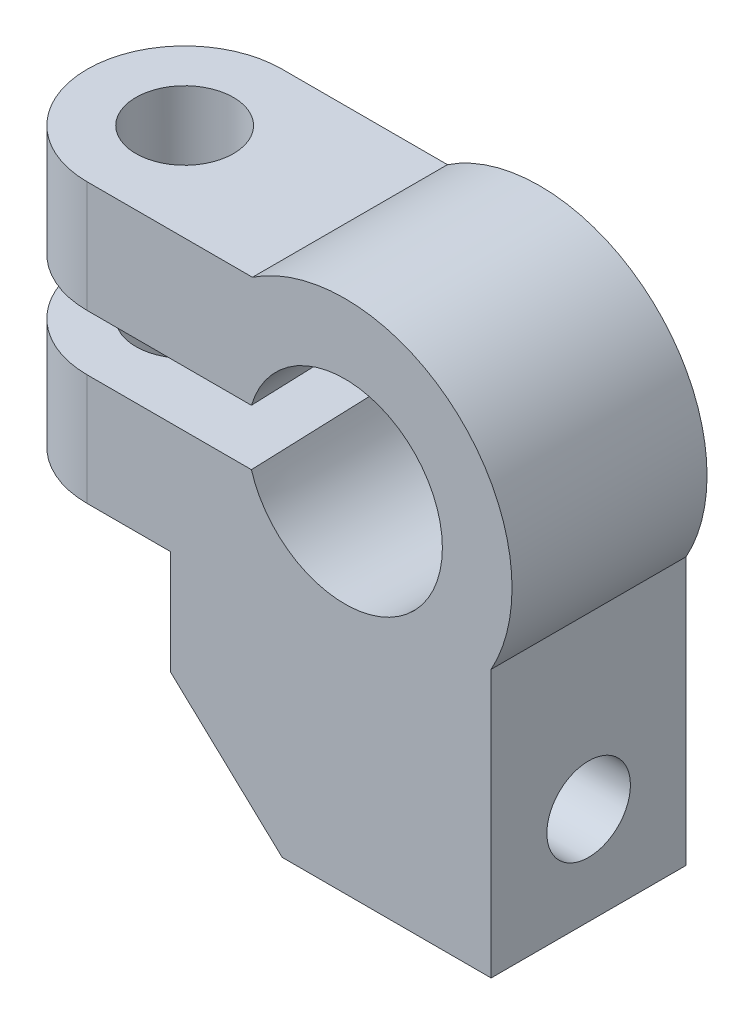
ISO-10303-21;
HEADER;
FILE_DESCRIPTION(('STEP AP214'),'2;1');
FILE_NAME('part.step','',(''),(''),'','','');
FILE_SCHEMA(('AUTOMOTIVE_DESIGN { 1 0 10303 214 1 1 1 1 }'));
ENDSEC;
DATA;
#1=APPLICATION_CONTEXT('core data for automotive mechanical design processes');
#2=APPLICATION_PROTOCOL_DEFINITION('international standard','automotive_design',2000,#1);
#3=PRODUCT_CONTEXT('',#1,'mechanical');
#4=PRODUCT('Part','Part','',(#3));
#5=PRODUCT_RELATED_PRODUCT_CATEGORY('part','',(#4));
#6=PRODUCT_DEFINITION_FORMATION('','',#4);
#7=PRODUCT_DEFINITION_CONTEXT('part definition',#1,'design');
#8=PRODUCT_DEFINITION('design','',#6,#7);
#9=PRODUCT_DEFINITION_SHAPE('','',#8);
#10=(LENGTH_UNIT() NAMED_UNIT(*) SI_UNIT(.MILLI.,.METRE.));
#11=(NAMED_UNIT(*) PLANE_ANGLE_UNIT() SI_UNIT($,.RADIAN.));
#12=(NAMED_UNIT(*) SI_UNIT($,.STERADIAN.) SOLID_ANGLE_UNIT());
#13=UNCERTAINTY_MEASURE_WITH_UNIT(LENGTH_MEASURE(1.E-05),#10,'distance_accuracy_value','');
#14=(GEOMETRIC_REPRESENTATION_CONTEXT(3) GLOBAL_UNCERTAINTY_ASSIGNED_CONTEXT((#13)) GLOBAL_UNIT_ASSIGNED_CONTEXT((#10,
#11,#12)) REPRESENTATION_CONTEXT('',''));
#15=CARTESIAN_POINT('',(0.,0.,0.));
#16=DIRECTION('',(0.,0.,1.));
#17=DIRECTION('',(1.,0.,0.));
#18=AXIS2_PLACEMENT_3D('',#15,#16,#17);
#19=CARTESIAN_POINT('',(0.,0.,28.));
#20=DIRECTION('',(0.,0.,1.));
#21=DIRECTION('',(1.,0.,0.));
#22=AXIS2_PLACEMENT_3D('',#19,#20,#21);
#23=PLANE('',#22);
#24=DIRECTION('',(0.,-1.,0.));
#25=VECTOR('',#24,1.);
#26=CARTESIAN_POINT('',(-37.,-20.,28.));
#27=LINE('',#26,#25);
#28=CARTESIAN_POINT('',(-37.,20.,28.));
#29=VERTEX_POINT('',#28);
#30=CARTESIAN_POINT('',(-37.,4.,28.));
#31=VERTEX_POINT('',#30);
#32=EDGE_CURVE('E608',#29,#31,#27,.T.);
#33=ORIENTED_EDGE('',*,*,#32,.T.);
#34=DIRECTION('',(1.,0.,0.));
#35=VECTOR('',#34,1.);
#36=CARTESIAN_POINT('',(0.,4.,28.));
#37=LINE('',#36,#35);
#38=CARTESIAN_POINT('',(-13.4164078649987,4.,28.));
#39=VERTEX_POINT('',#38);
#40=EDGE_CURVE('E363',#31,#39,#37,.T.);
#41=ORIENTED_EDGE('',*,*,#40,.T.);
#42=CARTESIAN_POINT('',(0.,0.,28.));
#43=DIRECTION('',(0.,0.,1.));
#44=DIRECTION('',(1.,0.,0.));
#45=AXIS2_PLACEMENT_3D('',#42,#43,#44);
#46=CIRCLE('',#45,14.);
#47=CARTESIAN_POINT('',(-13.4164078649987,-4.,28.));
#48=VERTEX_POINT('',#47);
#49=EDGE_CURVE('E635',#48,#39,#46,.T.);
#50=ORIENTED_EDGE('',*,*,#49,.F.);
#51=DIRECTION('',(-1.,0.,0.));
#52=VECTOR('',#51,1.);
#53=CARTESIAN_POINT('',(0.,-4.,28.));
#54=LINE('',#53,#52);
#55=CARTESIAN_POINT('',(-37.,-4.,28.));
#56=VERTEX_POINT('',#55);
#57=EDGE_CURVE('E469',#48,#56,#54,.T.);
#58=ORIENTED_EDGE('',*,*,#57,.T.);
#59=CARTESIAN_POINT('',(-37.,-20.,28.));
#60=VERTEX_POINT('',#59);
#61=EDGE_CURVE('E607',#56,#60,#27,.T.);
#62=ORIENTED_EDGE('',*,*,#61,.T.);
#63=DIRECTION('',(1.,0.,0.));
#64=VECTOR('',#63,1.);
#65=CARTESIAN_POINT('',(-51.,-20.,28.));
#66=LINE('',#65,#64);
#67=CARTESIAN_POINT('',(-25.,-20.,28.));
#68=VERTEX_POINT('',#67);
#69=EDGE_CURVE('E567',#60,#68,#66,.T.);
#70=ORIENTED_EDGE('',*,*,#69,.T.);
#71=DIRECTION('',(0.,-1.,0.));
#72=VECTOR('',#71,1.);
#73=CARTESIAN_POINT('',(-25.,-20.,28.));
#74=LINE('',#73,#72);
#75=CARTESIAN_POINT('',(-25.,-35.,28.));
#76=VERTEX_POINT('',#75);
#77=EDGE_CURVE('E574',#68,#76,#74,.T.);
#78=ORIENTED_EDGE('',*,*,#77,.T.);
#79=DIRECTION('',(0.729537204140085,-0.68394112888133,0.));
#80=VECTOR('',#79,1.);
#81=CARTESIAN_POINT('',(-25.,-35.,28.));
#82=LINE('',#81,#80);
#83=CARTESIAN_POINT('',(-9.,-50.,28.));
#84=VERTEX_POINT('',#83);
#85=EDGE_CURVE('E577',#76,#84,#82,.T.);
#86=ORIENTED_EDGE('',*,*,#85,.T.);
#87=DIRECTION('',(1.,0.,0.));
#88=VECTOR('',#87,1.);
#89=CARTESIAN_POINT('',(-9.,-50.,28.));
#90=LINE('',#89,#88);
#91=CARTESIAN_POINT('',(21.,-50.,28.));
#92=VERTEX_POINT('',#91);
#93=EDGE_CURVE('E585',#84,#92,#90,.T.);
#94=ORIENTED_EDGE('',*,*,#93,.T.);
#95=DIRECTION('',(0.,1.,0.));
#96=VECTOR('',#95,1.);
#97=CARTESIAN_POINT('',(21.,-50.,28.));
#98=LINE('',#97,#96);
#99=CARTESIAN_POINT('',(21.,-11.6189500386222,28.));
#100=VERTEX_POINT('',#99);
#101=EDGE_CURVE('E587',#92,#100,#98,.T.);
#102=ORIENTED_EDGE('',*,*,#101,.T.);
#103=CARTESIAN_POINT('',(0.,0.,28.));
#104=DIRECTION('',(0.,0.,1.));
#105=DIRECTION('',(1.,0.,0.));
#106=AXIS2_PLACEMENT_3D('',#103,#104,#105);
#107=CIRCLE('',#106,24.);
#108=CARTESIAN_POINT('',(-13.2664991614216,20.,28.));
#109=VERTEX_POINT('',#108);
#110=EDGE_CURVE('E589',#100,#109,#107,.T.);
#111=ORIENTED_EDGE('',*,*,#110,.T.);
#112=DIRECTION('',(-1.,0.,0.));
#113=VECTOR('',#112,1.);
#114=CARTESIAN_POINT('',(-51.,20.,28.));
#115=LINE('',#114,#113);
#116=EDGE_CURVE('E575',#109,#29,#115,.T.);
#117=ORIENTED_EDGE('',*,*,#116,.T.);
#118=EDGE_LOOP('',(#33,#41,#50,#58,#62,#70,#78,#86,#94,#102,#111,#117));
#119=FACE_BOUND('',#118,.T.);
#120=ADVANCED_FACE('F348',(#119),#23,.T.);
#121=CARTESIAN_POINT('',(0.,0.,0.));
#122=DIRECTION('',(0.,0.,1.));
#123=DIRECTION('',(1.,0.,0.));
#124=AXIS2_PLACEMENT_3D('',#121,#122,#123);
#125=PLANE('',#124);
#126=DIRECTION('',(1.,0.,0.));
#127=VECTOR('',#126,1.);
#128=CARTESIAN_POINT('',(0.,4.,0.));
#129=LINE('',#128,#127);
#130=CARTESIAN_POINT('',(-37.,4.,0.));
#131=VERTEX_POINT('',#130);
#132=CARTESIAN_POINT('',(-14.4337777464106,4.,0.));
#133=VERTEX_POINT('',#132);
#134=EDGE_CURVE('E664',#131,#133,#129,.T.);
#135=ORIENTED_EDGE('',*,*,#134,.F.);
#136=DIRECTION('',(0.,-1.,0.));
#137=VECTOR('',#136,1.);
#138=CARTESIAN_POINT('',(-37.,0.,0.));
#139=LINE('',#138,#137);
#140=CARTESIAN_POINT('',(-37.,20.,0.));
#141=VERTEX_POINT('',#140);
#142=EDGE_CURVE('E617',#131,#141,#139,.F.);
#143=ORIENTED_EDGE('',*,*,#142,.T.);
#144=DIRECTION('',(-1.,0.,0.));
#145=VECTOR('',#144,1.);
#146=CARTESIAN_POINT('',(-51.,20.,0.));
#147=LINE('',#146,#145);
#148=CARTESIAN_POINT('',(-13.2664991614216,20.,0.));
#149=VERTEX_POINT('',#148);
#150=EDGE_CURVE('E641',#149,#141,#147,.T.);
#151=ORIENTED_EDGE('',*,*,#150,.F.);
#152=CARTESIAN_POINT('',(0.,0.,0.));
#153=DIRECTION('',(0.,0.,1.));
#154=DIRECTION('',(1.,0.,0.));
#155=AXIS2_PLACEMENT_3D('',#152,#153,#154);
#156=CIRCLE('',#155,24.);
#157=CARTESIAN_POINT('',(21.,-11.6189500386222,0.));
#158=VERTEX_POINT('',#157);
#159=EDGE_CURVE('E580',#158,#149,#156,.T.);
#160=ORIENTED_EDGE('',*,*,#159,.F.);
#161=DIRECTION('',(0.,1.,0.));
#162=VECTOR('',#161,1.);
#163=CARTESIAN_POINT('',(21.,-50.,0.));
#164=LINE('',#163,#162);
#165=CARTESIAN_POINT('',(21.,-50.,0.));
#166=VERTEX_POINT('',#165);
#167=EDGE_CURVE('E652',#166,#158,#164,.T.);
#168=ORIENTED_EDGE('',*,*,#167,.F.);
#169=DIRECTION('',(1.,0.,0.));
#170=VECTOR('',#169,1.);
#171=CARTESIAN_POINT('',(-9.,-50.,0.));
#172=LINE('',#171,#170);
#173=CARTESIAN_POINT('',(-9.,-50.,0.));
#174=VERTEX_POINT('',#173);
#175=EDGE_CURVE('E650',#174,#166,#172,.T.);
#176=ORIENTED_EDGE('',*,*,#175,.F.);
#177=DIRECTION('',(0.729537204140085,-0.68394112888133,0.));
#178=VECTOR('',#177,1.);
#179=CARTESIAN_POINT('',(-25.,-35.,0.));
#180=LINE('',#179,#178);
#181=CARTESIAN_POINT('',(-25.,-35.,0.));
#182=VERTEX_POINT('',#181);
#183=EDGE_CURVE('E648',#182,#174,#180,.T.);
#184=ORIENTED_EDGE('',*,*,#183,.F.);
#185=DIRECTION('',(0.,-1.,0.));
#186=VECTOR('',#185,1.);
#187=CARTESIAN_POINT('',(-25.,-20.,0.));
#188=LINE('',#187,#186);
#189=CARTESIAN_POINT('',(-25.,-20.,0.));
#190=VERTEX_POINT('',#189);
#191=EDGE_CURVE('E646',#190,#182,#188,.T.);
#192=ORIENTED_EDGE('',*,*,#191,.F.);
#193=DIRECTION('',(1.,0.,0.));
#194=VECTOR('',#193,1.);
#195=CARTESIAN_POINT('',(-51.,-20.,0.));
#196=LINE('',#195,#194);
#197=CARTESIAN_POINT('',(-37.,-20.,0.));
#198=VERTEX_POINT('',#197);
#199=EDGE_CURVE('E644',#198,#190,#196,.T.);
#200=ORIENTED_EDGE('',*,*,#199,.F.);
#201=CARTESIAN_POINT('',(-37.,-4.,0.));
#202=VERTEX_POINT('',#201);
#203=EDGE_CURVE('E618',#198,#202,#139,.F.);
#204=ORIENTED_EDGE('',*,*,#203,.T.);
#205=DIRECTION('',(-1.,0.,0.));
#206=VECTOR('',#205,1.);
#207=CARTESIAN_POINT('',(0.,-4.,0.));
#208=LINE('',#207,#206);
#209=CARTESIAN_POINT('',(-14.4337777464106,-4.,0.));
#210=VERTEX_POINT('',#209);
#211=EDGE_CURVE('E467',#210,#202,#208,.T.);
#212=ORIENTED_EDGE('',*,*,#211,.F.);
#213=CARTESIAN_POINT('',(0.,0.,0.));
#214=DIRECTION('',(0.,0.,1.));
#215=DIRECTION('',(1.,0.,0.));
#216=AXIS2_PLACEMENT_3D('',#213,#214,#215);
#217=CIRCLE('',#216,14.9777815457689);
#218=EDGE_CURVE('E638',#210,#133,#217,.T.);
#219=ORIENTED_EDGE('',*,*,#218,.T.);
#220=EDGE_LOOP('',(#135,#143,#151,#160,#168,#176,#184,#192,#200,#204,#212,#219));
#221=FACE_BOUND('',#220,.T.);
#222=ADVANCED_FACE('F491',(#221),#125,.F.);
#223=CARTESIAN_POINT('',(0.,0.,28.));
#224=DIRECTION('',(0.,0.,-1.));
#225=DIRECTION('',(1.,0.,0.));
#226=AXIS2_PLACEMENT_3D('',#223,#224,#225);
#227=CONICAL_SURFACE('',#226,14.,0.0349065850398867);
#228=CARTESIAN_POINT('',(-15.3380679210751,4.,-25.0076257256379));
#229=CARTESIAN_POINT('',(-15.165569298085,4.,-20.2277998296334));
#230=CARTESIAN_POINT('',(-14.9928872180665,4.,-15.4479805537252));
#231=CARTESIAN_POINT('',(-14.6471122295986,4.,-5.88835682991105));
#232=CARTESIAN_POINT('',(-14.4740193211466,4.,-1.10855238200515));
#233=CARTESIAN_POINT('',(-13.9540584861186,4.,13.2308362124138));
#234=CARTESIAN_POINT('',(-13.6065084488468,4.,22.7903956380216));
#235=CARTESIAN_POINT('',(-12.8972037729529,4.,42.2364769625243));
#236=CARTESIAN_POINT('',(-12.5353699554243,4.,52.1229959756068));
#237=CARTESIAN_POINT('',(-11.9902581245743,4.,66.9526878728642));
#238=CARTESIAN_POINT('',(-11.808160660422,4.,71.8959041520865));
#239=CARTESIAN_POINT('',(-11.4430546087097,4.,81.7823031030507));
#240=CARTESIAN_POINT('',(-11.2600460211416,4.,86.7254857747924));
#241=CARTESIAN_POINT('',(-11.0765198282129,4.,91.6686492598829));
#242=B_SPLINE_CURVE_WITH_KNOTS('',3,(#228,#229,#230,#231,#232,#233,#234,#235,#236,#237,#238,
#239,#240,#241),.UNSPECIFIED.,.F.,.F.,(4,2,2,2,2,2,4),(0.,14.3488125716595,28.6976252405696,
57.3952504931537,87.0746644263557,101.914371896488,116.754079499273),.UNSPECIFIED.);
#243=EDGE_CURVE('E497',#133,#39,#242,.T.);
#244=ORIENTED_EDGE('',*,*,#243,.F.);
#245=ORIENTED_EDGE('',*,*,#218,.F.);
#246=CARTESIAN_POINT('',(-15.3380679210745,-4.,-25.0076257256217));
#247=CARTESIAN_POINT('',(-15.1655692980845,-4.,-20.2277998296198));
#248=CARTESIAN_POINT('',(-14.9928872180661,-4.,-15.4479805537141));
#249=CARTESIAN_POINT('',(-14.6471122295984,-4.,-5.88835682990489));
#250=CARTESIAN_POINT('',(-14.4740193211464,-4.,-1.1085523820015));
#251=CARTESIAN_POINT('',(-13.9540584861187,-4.,13.2308362124091));
#252=CARTESIAN_POINT('',(-13.6065084488471,-4.,22.7903956380112));
#253=CARTESIAN_POINT('',(-12.8972037729535,-4.,42.2364769625081));
#254=CARTESIAN_POINT('',(-12.5353699554249,-4.,52.1229959755906));
#255=CARTESIAN_POINT('',(-11.9902581245749,-4.,66.9526878728481));
#256=CARTESIAN_POINT('',(-11.8081606604226,-4.,71.8959041520704));
#257=CARTESIAN_POINT('',(-11.4430546087103,-4.,81.7823031030346));
#258=CARTESIAN_POINT('',(-11.2600460211422,-4.,86.7254857747762));
#259=CARTESIAN_POINT('',(-11.0765198282135,-4.,91.6686492598668));
#260=B_SPLINE_CURVE_WITH_KNOTS('',3,(#246,#247,#248,#249,#250,#251,#252,#253,#254,#255,#256,
#257,#258,#259),.UNSPECIFIED.,.F.,.F.,(4,2,2,2,2,2,4),(0.,14.3488125716519,28.6976252405545,
57.3952504931212,87.0746644263234,101.914371896455,116.75407949924),.UNSPECIFIED.);
#261=EDGE_CURVE('E472',#48,#210,#260,.F.);
#262=ORIENTED_EDGE('',*,*,#261,.F.);
#263=ORIENTED_EDGE('',*,*,#49,.T.);
#264=EDGE_LOOP('',(#244,#245,#262,#263));
#265=FACE_BOUND('',#264,.T.);
#266=ADVANCED_FACE('F485',(#265),#227,.F.);
#267=CARTESIAN_POINT('',(-37.,20.,14.));
#268=DIRECTION('',(0.,-1.,0.));
#269=DIRECTION('',(1.,0.,0.));
#270=AXIS2_PLACEMENT_3D('',#267,#268,#269);
#271=CYLINDRICAL_SURFACE('',#270,14.);
#272=ORIENTED_EDGE('',*,*,#142,.F.);
#273=CARTESIAN_POINT('',(-37.,4.,14.));
#274=DIRECTION('',(0.,-1.,0.));
#275=DIRECTION('',(1.,0.,0.));
#276=AXIS2_PLACEMENT_3D('',#273,#274,#275);
#277=CIRCLE('',#276,14.);
#278=CARTESIAN_POINT('',(-51.,4.,14.));
#279=VERTEX_POINT('',#278);
#280=EDGE_CURVE('E668',#131,#279,#277,.F.);
#281=ORIENTED_EDGE('',*,*,#280,.T.);
#282=DIRECTION('',(0.,-1.,0.));
#283=VECTOR('',#282,1.);
#284=CARTESIAN_POINT('',(-51.,20.,14.));
#285=LINE('',#284,#283);
#286=CARTESIAN_POINT('',(-51.,20.,14.));
#287=VERTEX_POINT('',#286);
#288=EDGE_CURVE('E632',#287,#279,#285,.T.);
#289=ORIENTED_EDGE('',*,*,#288,.F.);
#290=CARTESIAN_POINT('',(-37.,20.,14.));
#291=DIRECTION('',(0.,-1.,0.));
#292=DIRECTION('',(0.,0.,-1.));
#293=AXIS2_PLACEMENT_3D('',#290,#291,#292);
#294=CIRCLE('',#293,14.);
#295=EDGE_CURVE('E613',#141,#287,#294,.F.);
#296=ORIENTED_EDGE('',*,*,#295,.F.);
#297=EDGE_LOOP('',(#272,#281,#289,#296));
#298=FACE_BOUND('',#297,.T.);
#299=ADVANCED_FACE('F490',(#298),#271,.T.);
#300=CARTESIAN_POINT('',(-51.,-4.,14.));
#301=VERTEX_POINT('',#300);
#302=CARTESIAN_POINT('',(-51.,-20.,14.));
#303=VERTEX_POINT('',#302);
#304=EDGE_CURVE('E630',#301,#303,#285,.T.);
#305=ORIENTED_EDGE('',*,*,#304,.F.);
#306=CARTESIAN_POINT('',(-37.,-4.,14.));
#307=DIRECTION('',(0.,1.,0.));
#308=DIRECTION('',(0.,0.,1.));
#309=AXIS2_PLACEMENT_3D('',#306,#307,#308);
#310=CIRCLE('',#309,14.);
#311=EDGE_CURVE('E371',#301,#202,#310,.F.);
#312=ORIENTED_EDGE('',*,*,#311,.T.);
#313=ORIENTED_EDGE('',*,*,#203,.F.);
#314=CARTESIAN_POINT('',(-37.,-20.,14.));
#315=DIRECTION('',(0.,1.,0.));
#316=DIRECTION('',(-1.,0.,0.));
#317=AXIS2_PLACEMENT_3D('',#314,#315,#316);
#318=CIRCLE('',#317,14.);
#319=EDGE_CURVE('E610',#303,#198,#318,.F.);
#320=ORIENTED_EDGE('',*,*,#319,.F.);
#321=EDGE_LOOP('',(#305,#312,#313,#320));
#322=FACE_BOUND('',#321,.T.);
#323=ADVANCED_FACE('F518',(#322),#271,.T.);
#324=CARTESIAN_POINT('',(-37.,0.,14.));
#325=DIRECTION('',(0.,1.,0.));
#326=DIRECTION('',(-1.,0.,0.));
#327=AXIS2_PLACEMENT_3D('',#324,#325,#326);
#328=CYLINDRICAL_SURFACE('',#327,14.);
#329=ORIENTED_EDGE('',*,*,#288,.T.);
#330=CARTESIAN_POINT('',(-37.,4.,14.));
#331=DIRECTION('',(0.,-1.,0.));
#332=DIRECTION('',(1.,0.,0.));
#333=AXIS2_PLACEMENT_3D('',#330,#331,#332);
#334=CIRCLE('',#333,14.);
#335=EDGE_CURVE('E479',#279,#31,#334,.F.);
#336=ORIENTED_EDGE('',*,*,#335,.T.);
#337=ORIENTED_EDGE('',*,*,#32,.F.);
#338=CARTESIAN_POINT('',(-37.,20.,14.));
#339=DIRECTION('',(0.,-1.,0.));
#340=DIRECTION('',(0.,0.,-1.));
#341=AXIS2_PLACEMENT_3D('',#338,#339,#340);
#342=CIRCLE('',#341,14.);
#343=EDGE_CURVE('E615',#287,#29,#342,.F.);
#344=ORIENTED_EDGE('',*,*,#343,.F.);
#345=EDGE_LOOP('',(#329,#336,#337,#344));
#346=FACE_BOUND('',#345,.T.);
#347=ADVANCED_FACE('F516',(#346),#328,.T.);
#348=ORIENTED_EDGE('',*,*,#61,.F.);
#349=CARTESIAN_POINT('',(-37.,-4.,14.));
#350=DIRECTION('',(0.,1.,0.));
#351=DIRECTION('',(0.,0.,1.));
#352=AXIS2_PLACEMENT_3D('',#349,#350,#351);
#353=CIRCLE('',#352,14.);
#354=EDGE_CURVE('E462',#56,#301,#353,.F.);
#355=ORIENTED_EDGE('',*,*,#354,.T.);
#356=ORIENTED_EDGE('',*,*,#304,.T.);
#357=CARTESIAN_POINT('',(-37.,-20.,14.));
#358=DIRECTION('',(0.,1.,0.));
#359=DIRECTION('',(-1.,0.,0.));
#360=AXIS2_PLACEMENT_3D('',#357,#358,#359);
#361=CIRCLE('',#360,14.);
#362=EDGE_CURVE('E569',#60,#303,#361,.F.);
#363=ORIENTED_EDGE('',*,*,#362,.F.);
#364=EDGE_LOOP('',(#348,#355,#356,#363));
#365=FACE_BOUND('',#364,.T.);
#366=ADVANCED_FACE('F514',(#365),#328,.T.);
#367=CARTESIAN_POINT('',(-37.,24.,14.));
#368=DIRECTION('',(0.,-1.,0.));
#369=DIRECTION('',(1.,0.,0.));
#370=AXIS2_PLACEMENT_3D('',#367,#368,#369);
#371=CYLINDRICAL_SURFACE('',#370,7.);
#372=CARTESIAN_POINT('',(-37.,20.,14.));
#373=DIRECTION('',(0.,-1.,0.));
#374=DIRECTION('',(0.,0.,-1.));
#375=AXIS2_PLACEMENT_3D('',#372,#373,#374);
#376=CIRCLE('',#375,7.);
#377=CARTESIAN_POINT('',(-37.,20.,7.));
#378=VERTEX_POINT('',#377);
#379=EDGE_CURVE('E628',#378,#378,#376,.T.);
#380=ORIENTED_EDGE('',*,*,#379,.F.);
#381=EDGE_LOOP('',(#380));
#382=FACE_BOUND('',#381,.T.);
#383=CARTESIAN_POINT('',(-37.,4.,14.));
#384=DIRECTION('',(0.,-1.,0.));
#385=DIRECTION('',(1.,0.,0.));
#386=AXIS2_PLACEMENT_3D('',#383,#384,#385);
#387=CIRCLE('',#386,7.);
#388=CARTESIAN_POINT('',(-30.,4.,14.));
#389=VERTEX_POINT('',#388);
#390=EDGE_CURVE('E11',#389,#389,#387,.F.);
#391=ORIENTED_EDGE('',*,*,#390,.F.);
#392=EDGE_LOOP('',(#391));
#393=FACE_BOUND('',#392,.T.);
#394=ADVANCED_FACE('F511',(#382,#393),#371,.F.);
#395=CARTESIAN_POINT('',(-37.,-20.,14.));
#396=DIRECTION('',(0.,-1.,0.));
#397=DIRECTION('',(1.,0.,0.));
#398=AXIS2_PLACEMENT_3D('',#395,#396,#397);
#399=CIRCLE('',#398,7.);
#400=CARTESIAN_POINT('',(-30.,-20.,14.));
#401=VERTEX_POINT('',#400);
#402=EDGE_CURVE('E503',#401,#401,#399,.T.);
#403=ORIENTED_EDGE('',*,*,#402,.T.);
#404=EDGE_LOOP('',(#403));
#405=FACE_BOUND('',#404,.T.);
#406=CARTESIAN_POINT('',(-37.,-4.,14.));
#407=DIRECTION('',(0.,1.,0.));
#408=DIRECTION('',(0.,0.,1.));
#409=AXIS2_PLACEMENT_3D('',#406,#407,#408);
#410=CIRCLE('',#409,7.);
#411=CARTESIAN_POINT('',(-37.,-4.,21.));
#412=VERTEX_POINT('',#411);
#413=EDGE_CURVE('E356',#412,#412,#410,.F.);
#414=ORIENTED_EDGE('',*,*,#413,.F.);
#415=EDGE_LOOP('',(#414));
#416=FACE_BOUND('',#415,.T.);
#417=ADVANCED_FACE('F513',(#405,#416),#371,.F.);
#418=CARTESIAN_POINT('',(-51.,20.,28.));
#419=DIRECTION('',(0.,-1.,0.));
#420=DIRECTION('',(0.,0.,-1.));
#421=AXIS2_PLACEMENT_3D('',#418,#419,#420);
#422=PLANE('',#421);
#423=ORIENTED_EDGE('',*,*,#379,.T.);
#424=EDGE_LOOP('',(#423));
#425=FACE_BOUND('',#424,.T.);
#426=ORIENTED_EDGE('',*,*,#295,.T.);
#427=ORIENTED_EDGE('',*,*,#343,.T.);
#428=ORIENTED_EDGE('',*,*,#116,.F.);
#429=DIRECTION('',(0.,0.,-1.));
#430=VECTOR('',#429,1.);
#431=CARTESIAN_POINT('',(-13.2664991614216,20.,28.));
#432=LINE('',#431,#430);
#433=EDGE_CURVE('E591',#109,#149,#432,.T.);
#434=ORIENTED_EDGE('',*,*,#433,.T.);
#435=ORIENTED_EDGE('',*,*,#150,.T.);
#436=EDGE_LOOP('',(#426,#427,#428,#434,#435));
#437=FACE_BOUND('',#436,.T.);
#438=ADVANCED_FACE('F350',(#425,#437),#422,.F.);
#439=CARTESIAN_POINT('',(-51.,-20.,28.));
#440=DIRECTION('',(0.,1.,0.));
#441=DIRECTION('',(-1.,0.,0.));
#442=AXIS2_PLACEMENT_3D('',#439,#440,#441);
#443=PLANE('',#442);
#444=ORIENTED_EDGE('',*,*,#402,.F.);
#445=EDGE_LOOP('',(#444));
#446=FACE_BOUND('',#445,.T.);
#447=ORIENTED_EDGE('',*,*,#69,.F.);
#448=ORIENTED_EDGE('',*,*,#362,.T.);
#449=ORIENTED_EDGE('',*,*,#319,.T.);
#450=ORIENTED_EDGE('',*,*,#199,.T.);
#451=DIRECTION('',(0.,0.,-1.));
#452=VECTOR('',#451,1.);
#453=CARTESIAN_POINT('',(-25.,-20.,28.));
#454=LINE('',#453,#452);
#455=EDGE_CURVE('E572',#68,#190,#454,.T.);
#456=ORIENTED_EDGE('',*,*,#455,.F.);
#457=EDGE_LOOP('',(#447,#448,#449,#450,#456));
#458=FACE_BOUND('',#457,.T.);
#459=ADVANCED_FACE('F553',(#446,#458),#443,.F.);
#460=CARTESIAN_POINT('',(-25.,-20.,28.));
#461=DIRECTION('',(1.,0.,0.));
#462=DIRECTION('',(0.,1.,0.));
#463=AXIS2_PLACEMENT_3D('',#460,#461,#462);
#464=PLANE('',#463);
#465=ORIENTED_EDGE('',*,*,#191,.T.);
#466=DIRECTION('',(0.,0.,-1.));
#467=VECTOR('',#466,1.);
#468=CARTESIAN_POINT('',(-25.,-35.,28.));
#469=LINE('',#468,#467);
#470=EDGE_CURVE('E603',#76,#182,#469,.T.);
#471=ORIENTED_EDGE('',*,*,#470,.F.);
#472=ORIENTED_EDGE('',*,*,#77,.F.);
#473=ORIENTED_EDGE('',*,*,#455,.T.);
#474=EDGE_LOOP('',(#465,#471,#472,#473));
#475=FACE_BOUND('',#474,.T.);
#476=ADVANCED_FACE('F550',(#475),#464,.F.);
#477=CARTESIAN_POINT('',(-25.,-35.,28.));
#478=DIRECTION('',(0.68394112888133,0.729537204140085,0.));
#479=DIRECTION('',(-0.729537204140085,0.68394112888133,0.));
#480=AXIS2_PLACEMENT_3D('',#477,#478,#479);
#481=PLANE('',#480);
#482=ORIENTED_EDGE('',*,*,#183,.T.);
#483=DIRECTION('',(0.,0.,-1.));
#484=VECTOR('',#483,1.);
#485=CARTESIAN_POINT('',(-9.,-50.,28.));
#486=LINE('',#485,#484);
#487=EDGE_CURVE('E600',#84,#174,#486,.T.);
#488=ORIENTED_EDGE('',*,*,#487,.F.);
#489=ORIENTED_EDGE('',*,*,#85,.F.);
#490=ORIENTED_EDGE('',*,*,#470,.T.);
#491=EDGE_LOOP('',(#482,#488,#489,#490));
#492=FACE_BOUND('',#491,.T.);
#493=ADVANCED_FACE('F546',(#492),#481,.F.);
#494=CARTESIAN_POINT('',(-9.,-50.,28.));
#495=DIRECTION('',(0.,1.,0.));
#496=DIRECTION('',(0.,0.,1.));
#497=AXIS2_PLACEMENT_3D('',#494,#495,#496);
#498=PLANE('',#497);
#499=ORIENTED_EDGE('',*,*,#175,.T.);
#500=DIRECTION('',(0.,0.,-1.));
#501=VECTOR('',#500,1.);
#502=CARTESIAN_POINT('',(21.,-50.,28.));
#503=LINE('',#502,#501);
#504=EDGE_CURVE('E597',#92,#166,#503,.T.);
#505=ORIENTED_EDGE('',*,*,#504,.F.);
#506=ORIENTED_EDGE('',*,*,#93,.F.);
#507=ORIENTED_EDGE('',*,*,#487,.T.);
#508=EDGE_LOOP('',(#499,#505,#506,#507));
#509=FACE_BOUND('',#508,.T.);
#510=ADVANCED_FACE('F542',(#509),#498,.F.);
#511=CARTESIAN_POINT('',(21.,-50.,28.));
#512=DIRECTION('',(-1.,0.,0.));
#513=DIRECTION('',(0.,0.,1.));
#514=AXIS2_PLACEMENT_3D('',#511,#512,#513);
#515=PLANE('',#514);
#516=CARTESIAN_POINT('',(21.,-36.,14.));
#517=DIRECTION('',(1.,0.,0.));
#518=DIRECTION('',(0.,0.,-1.));
#519=AXIS2_PLACEMENT_3D('',#516,#517,#518);
#520=CIRCLE('',#519,5.99999999999999);
#521=CARTESIAN_POINT('',(21.,-36.,8.00000000000001));
#522=VERTEX_POINT('',#521);
#523=EDGE_CURVE('E459',#522,#522,#520,.T.);
#524=ORIENTED_EDGE('',*,*,#523,.F.);
#525=EDGE_LOOP('',(#524));
#526=FACE_BOUND('',#525,.T.);
#527=ORIENTED_EDGE('',*,*,#167,.T.);
#528=DIRECTION('',(0.,0.,-1.));
#529=VECTOR('',#528,1.);
#530=CARTESIAN_POINT('',(21.,-11.6189500386222,28.));
#531=LINE('',#530,#529);
#532=EDGE_CURVE('E594',#100,#158,#531,.T.);
#533=ORIENTED_EDGE('',*,*,#532,.F.);
#534=ORIENTED_EDGE('',*,*,#101,.F.);
#535=ORIENTED_EDGE('',*,*,#504,.T.);
#536=EDGE_LOOP('',(#527,#533,#534,#535));
#537=FACE_BOUND('',#536,.T.);
#538=ADVANCED_FACE('F538',(#526,#537),#515,.F.);
#539=CARTESIAN_POINT('',(0.,0.,28.));
#540=DIRECTION('',(0.,0.,-1.));
#541=DIRECTION('',(-1.,0.,0.));
#542=AXIS2_PLACEMENT_3D('',#539,#540,#541);
#543=CYLINDRICAL_SURFACE('',#542,24.);
#544=ORIENTED_EDGE('',*,*,#159,.T.);
#545=ORIENTED_EDGE('',*,*,#433,.F.);
#546=ORIENTED_EDGE('',*,*,#110,.F.);
#547=ORIENTED_EDGE('',*,*,#532,.T.);
#548=EDGE_LOOP('',(#544,#545,#546,#547));
#549=FACE_BOUND('',#548,.T.);
#550=ADVANCED_FACE('F535',(#549),#543,.T.);
#551=CARTESIAN_POINT('',(-62.9690975805527,-4.,164.272933849683));
#552=DIRECTION('',(0.,1.,0.));
#553=DIRECTION('',(0.,0.,1.));
#554=AXIS2_PLACEMENT_3D('',#551,#552,#553);
#555=PLANE('',#554);
#556=ORIENTED_EDGE('',*,*,#413,.T.);
#557=EDGE_LOOP('',(#556));
#558=FACE_BOUND('',#557,.T.);
#559=ORIENTED_EDGE('',*,*,#57,.F.);
#560=ORIENTED_EDGE('',*,*,#261,.T.);
#561=ORIENTED_EDGE('',*,*,#211,.T.);
#562=ORIENTED_EDGE('',*,*,#311,.F.);
#563=ORIENTED_EDGE('',*,*,#354,.F.);
#564=EDGE_LOOP('',(#559,#560,#561,#562,#563));
#565=FACE_BOUND('',#564,.T.);
#566=ADVANCED_FACE('F481',(#558,#565),#555,.T.);
#567=CARTESIAN_POINT('',(-4.52520000352819,4.,164.272933849683));
#568=DIRECTION('',(0.,-1.,0.));
#569=DIRECTION('',(1.,0.,0.));
#570=AXIS2_PLACEMENT_3D('',#567,#568,#569);
#571=PLANE('',#570);
#572=ORIENTED_EDGE('',*,*,#390,.T.);
#573=EDGE_LOOP('',(#572));
#574=FACE_BOUND('',#573,.T.);
#575=ORIENTED_EDGE('',*,*,#134,.T.);
#576=ORIENTED_EDGE('',*,*,#243,.T.);
#577=ORIENTED_EDGE('',*,*,#40,.F.);
#578=ORIENTED_EDGE('',*,*,#335,.F.);
#579=ORIENTED_EDGE('',*,*,#280,.F.);
#580=EDGE_LOOP('',(#575,#576,#577,#578,#579));
#581=FACE_BOUND('',#580,.T.);
#582=ADVANCED_FACE('F506',(#574,#581),#571,.T.);
#583=CARTESIAN_POINT('',(21.,-36.,14.));
#584=DIRECTION('',(1.,0.,0.));
#585=DIRECTION('',(0.,0.,-1.));
#586=AXIS2_PLACEMENT_3D('',#583,#584,#585);
#587=CYLINDRICAL_SURFACE('',#586,5.99999999999999);
#588=CARTESIAN_POINT('',(-3.,-36.,14.));
#589=DIRECTION('',(1.,0.,0.));
#590=DIRECTION('',(0.,0.,-1.));
#591=AXIS2_PLACEMENT_3D('',#588,#589,#590);
#592=CIRCLE('',#591,5.99999999999999);
#593=CARTESIAN_POINT('',(-3.,-36.,8.00000000000001));
#594=VERTEX_POINT('',#593);
#595=EDGE_CURVE('E457',#594,#594,#592,.T.);
#596=ORIENTED_EDGE('',*,*,#595,.F.);
#597=EDGE_LOOP('',(#596));
#598=FACE_BOUND('',#597,.T.);
#599=ORIENTED_EDGE('',*,*,#523,.T.);
#600=EDGE_LOOP('',(#599));
#601=FACE_BOUND('',#600,.T.);
#602=ADVANCED_FACE('F453',(#598,#601),#587,.F.);
#603=CARTESIAN_POINT('',(-3.,-36.,14.));
#604=DIRECTION('',(1.,0.,0.));
#605=DIRECTION('',(0.,0.,-1.));
#606=AXIS2_PLACEMENT_3D('',#603,#604,#605);
#607=CONICAL_SURFACE('',#606,5.99999999999999,1.0471975511966);
#608=CARTESIAN_POINT('',(-6.46410161513776,-36.,14.));
#609=VERTEX_POINT('',#608);
#610=VERTEX_LOOP('',#609);
#611=FACE_BOUND('',#610,.T.);
#612=ORIENTED_EDGE('',*,*,#595,.T.);
#613=EDGE_LOOP('',(#612));
#614=FACE_BOUND('',#613,.T.);
#615=ADVANCED_FACE('F450',(#611,#614),#607,.F.);
#616=CLOSED_SHELL('',(#120,#222,#266,#299,#323,#347,#366,#394,#417,#438,#459,#476,#493,#510,
#538,#550,#566,#582,#602,#615));
#617=MANIFOLD_SOLID_BREP('B2',#616);
#618=ADVANCED_BREP_SHAPE_REPRESENTATION('',(#18,#617),#14);
#619=SHAPE_DEFINITION_REPRESENTATION(#9,#618);
ENDSEC;
END-ISO-10303-21;
